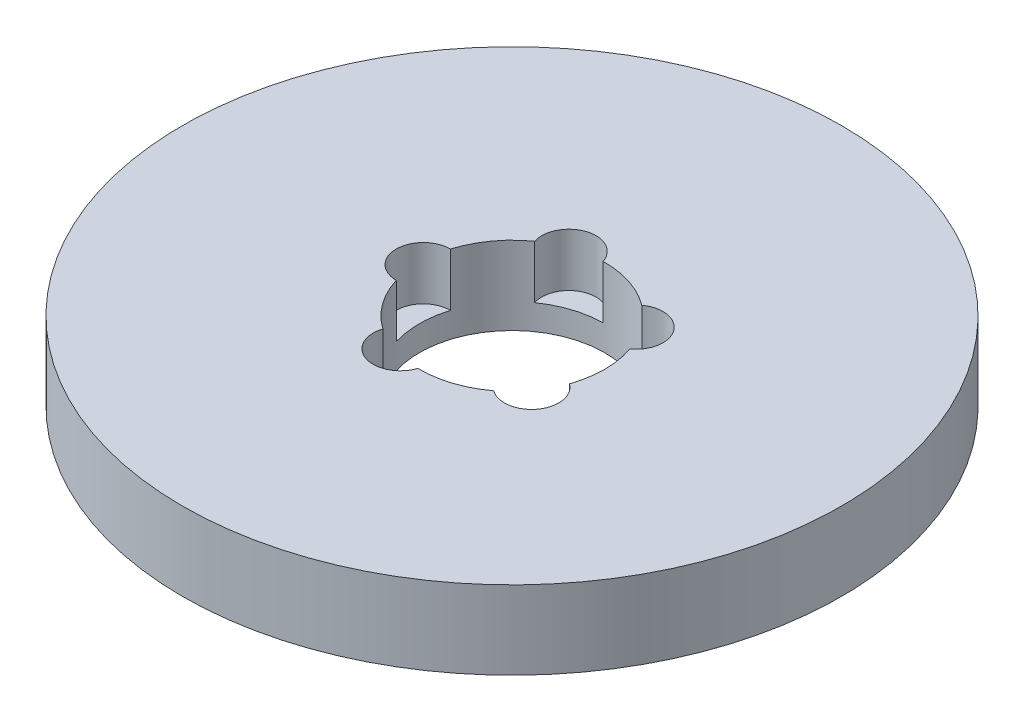
ISO-10303-21;
HEADER;
FILE_DESCRIPTION(('STEP AP214'),'2;1');
FILE_NAME('part.step','',(''),(''),'','','');
FILE_SCHEMA(('AUTOMOTIVE_DESIGN { 1 0 10303 214 1 1 1 1 }'));
ENDSEC;
DATA;
#1=APPLICATION_CONTEXT('core data for automotive mechanical design processes');
#2=APPLICATION_PROTOCOL_DEFINITION('international standard','automotive_design',2000,#1);
#3=PRODUCT_CONTEXT('',#1,'mechanical');
#4=PRODUCT('Part','Part','',(#3));
#5=PRODUCT_RELATED_PRODUCT_CATEGORY('part','',(#4));
#6=PRODUCT_DEFINITION_FORMATION('','',#4);
#7=PRODUCT_DEFINITION_CONTEXT('part definition',#1,'design');
#8=PRODUCT_DEFINITION('design','',#6,#7);
#9=PRODUCT_DEFINITION_SHAPE('','',#8);
#10=(LENGTH_UNIT() NAMED_UNIT(*) SI_UNIT(.MILLI.,.METRE.));
#11=(NAMED_UNIT(*) PLANE_ANGLE_UNIT() SI_UNIT($,.RADIAN.));
#12=(NAMED_UNIT(*) SI_UNIT($,.STERADIAN.) SOLID_ANGLE_UNIT());
#13=UNCERTAINTY_MEASURE_WITH_UNIT(LENGTH_MEASURE(1.E-05),#10,'distance_accuracy_value','');
#14=(GEOMETRIC_REPRESENTATION_CONTEXT(3) GLOBAL_UNCERTAINTY_ASSIGNED_CONTEXT((#13)) GLOBAL_UNIT_ASSIGNED_CONTEXT((#10,
#11,#12)) REPRESENTATION_CONTEXT('',''));
#15=CARTESIAN_POINT('',(0.,0.,0.));
#16=DIRECTION('',(0.,0.,1.));
#17=DIRECTION('',(1.,0.,0.));
#18=AXIS2_PLACEMENT_3D('',#15,#16,#17);
#19=CARTESIAN_POINT('',(0.,19.,0.));
#20=DIRECTION('',(0.,-1.,0.));
#21=DIRECTION('',(0.,0.,-1.));
#22=AXIS2_PLACEMENT_3D('',#19,#20,#21);
#23=CYLINDRICAL_SURFACE('',#22,80.);
#24=CARTESIAN_POINT('',(0.,19.,0.));
#25=DIRECTION('',(0.,1.,0.));
#26=DIRECTION('',(0.,0.,1.));
#27=AXIS2_PLACEMENT_3D('',#24,#25,#26);
#28=CIRCLE('',#27,80.);
#29=CARTESIAN_POINT('',(0.,19.,80.));
#30=VERTEX_POINT('',#29);
#31=EDGE_CURVE('E157',#30,#30,#28,.T.);
#32=ORIENTED_EDGE('',*,*,#31,.F.);
#33=EDGE_LOOP('',(#32));
#34=FACE_BOUND('',#33,.T.);
#35=CARTESIAN_POINT('',(0.,0.,0.));
#36=DIRECTION('',(0.,1.,0.));
#37=DIRECTION('',(0.,0.,1.));
#38=AXIS2_PLACEMENT_3D('',#35,#36,#37);
#39=CIRCLE('',#38,80.);
#40=CARTESIAN_POINT('',(0.,0.,80.));
#41=VERTEX_POINT('',#40);
#42=EDGE_CURVE('E150',#41,#41,#39,.T.);
#43=ORIENTED_EDGE('',*,*,#42,.T.);
#44=EDGE_LOOP('',(#43));
#45=FACE_BOUND('',#44,.T.);
#46=ADVANCED_FACE('F39',(#34,#45),#23,.T.);
#47=CARTESIAN_POINT('',(0.,19.,0.));
#48=DIRECTION('',(0.,1.,0.));
#49=DIRECTION('',(0.,0.,1.));
#50=AXIS2_PLACEMENT_3D('',#47,#48,#49);
#51=PLANE('',#50);
#52=CARTESIAN_POINT('',(-6.65133725210764,19.,-20.4707111610114));
#53=DIRECTION('',(0.,1.,0.));
#54=DIRECTION('',(-0.95105651629515,0.,0.309016994374958));
#55=AXIS2_PLACEMENT_3D('',#52,#53,#54);
#56=CIRCLE('',#55,6.58097979710222);
#57=CARTESIAN_POINT('',(-0.38994875628982,19.,-22.4966206343857));
#58=VERTEX_POINT('',#57);
#59=CARTESIAN_POINT('',(-12.907706664537,19.,-18.4293545373208));
#60=VERTEX_POINT('',#59);
#61=EDGE_CURVE('E194',#58,#60,#56,.T.);
#62=ORIENTED_EDGE('',*,*,#61,.F.);
#63=CARTESIAN_POINT('',(0.,19.,0.));
#64=DIRECTION('',(0.,1.,0.));
#65=DIRECTION('',(0.,0.,1.));
#66=AXIS2_PLACEMENT_3D('',#63,#64,#65);
#67=CIRCLE('',#66,22.5);
#68=CARTESIAN_POINT('',(13.5386570060839,19.,-17.9709422811275));
#69=VERTEX_POINT('',#68);
#70=EDGE_CURVE('E147',#69,#58,#67,.T.);
#71=ORIENTED_EDGE('',*,*,#70,.F.);
#72=CARTESIAN_POINT('',(17.4134269966554,19.,-12.6515952713871));
#73=DIRECTION('',(0.,1.,0.));
#74=DIRECTION('',(-0.58778525229248,0.,-0.809016994374942));
#75=AXIS2_PLACEMENT_3D('',#72,#73,#74);
#76=CIRCLE('',#75,6.58097979710222);
#77=CARTESIAN_POINT('',(21.2750568563236,19.,-7.32270139772186));
#78=VERTEX_POINT('',#77);
#79=EDGE_CURVE('E254',#78,#69,#76,.T.);
#80=ORIENTED_EDGE('',*,*,#79,.F.);
#81=CARTESIAN_POINT('',(21.2750568563237,19.,7.32270139772155));
#82=VERTEX_POINT('',#81);
#83=EDGE_CURVE('E144',#82,#78,#67,.T.);
#84=ORIENTED_EDGE('',*,*,#83,.F.);
#85=CARTESIAN_POINT('',(17.4134269966556,19.,12.6515952713868));
#86=DIRECTION('',(0.,1.,0.));
#87=DIRECTION('',(0.587785252292469,0.,-0.809016994374951));
#88=AXIS2_PLACEMENT_3D('',#85,#86,#87);
#89=CIRCLE('',#88,6.58097979710222);
#90=CARTESIAN_POINT('',(13.5386570060842,19.,17.9709422811273));
#91=VERTEX_POINT('',#90);
#92=EDGE_CURVE('E141',#91,#82,#89,.T.);
#93=ORIENTED_EDGE('',*,*,#92,.F.);
#94=CARTESIAN_POINT('',(-0.389948756289501,19.,22.4966206343857));
#95=VERTEX_POINT('',#94);
#96=EDGE_CURVE('E134',#95,#91,#67,.T.);
#97=ORIENTED_EDGE('',*,*,#96,.F.);
#98=CARTESIAN_POINT('',(-6.65133725210735,19.,20.4707111610115));
#99=DIRECTION('',(0.,1.,0.));
#100=DIRECTION('',(0.951056516295155,0.,0.309016994374945));
#101=AXIS2_PLACEMENT_3D('',#98,#99,#100);
#102=CIRCLE('',#101,6.58097979710222);
#103=CARTESIAN_POINT('',(-12.9077066645368,19.,18.429354537321));
#104=VERTEX_POINT('',#103);
#105=EDGE_CURVE('E111',#104,#95,#102,.T.);
#106=ORIENTED_EDGE('',*,*,#105,.F.);
#107=CARTESIAN_POINT('',(-21.5160584415814,19.,6.58097478634091));
#108=VERTEX_POINT('',#107);
#109=EDGE_CURVE('E145',#108,#104,#67,.T.);
#110=ORIENTED_EDGE('',*,*,#109,.F.);
#111=CARTESIAN_POINT('',(-21.5241794890962,19.,0.));
#112=DIRECTION('',(0.,1.,0.));
#113=DIRECTION('',(0.,0.,1.));
#114=AXIS2_PLACEMENT_3D('',#111,#112,#113);
#115=CIRCLE('',#114,6.58097979710222);
#116=CARTESIAN_POINT('',(-21.5160584415814,19.,-6.58097478634091));
#117=VERTEX_POINT('',#116);
#118=EDGE_CURVE('E153',#117,#108,#115,.T.);
#119=ORIENTED_EDGE('',*,*,#118,.F.);
#120=EDGE_CURVE('E146',#60,#117,#67,.T.);
#121=ORIENTED_EDGE('',*,*,#120,.F.);
#122=EDGE_LOOP('',(#62,#71,#80,#84,#93,#97,#106,#110,#119,#121));
#123=FACE_BOUND('',#122,.T.);
#124=ORIENTED_EDGE('',*,*,#31,.T.);
#125=EDGE_LOOP('',(#124));
#126=FACE_BOUND('',#125,.T.);
#127=ADVANCED_FACE('F139',(#123,#126),#51,.T.);
#128=CARTESIAN_POINT('',(0.,0.,0.));
#129=DIRECTION('',(0.,1.,0.));
#130=DIRECTION('',(0.,0.,1.));
#131=AXIS2_PLACEMENT_3D('',#128,#129,#130);
#132=PLANE('',#131);
#133=CARTESIAN_POINT('',(0.,0.,0.));
#134=DIRECTION('',(0.,1.,0.));
#135=DIRECTION('',(0.,0.,1.));
#136=AXIS2_PLACEMENT_3D('',#133,#134,#135);
#137=CIRCLE('',#136,22.5);
#138=CARTESIAN_POINT('',(0.,0.,22.5));
#139=VERTEX_POINT('',#138);
#140=EDGE_CURVE('E154',#139,#139,#137,.T.);
#141=ORIENTED_EDGE('',*,*,#140,.T.);
#142=EDGE_LOOP('',(#141));
#143=FACE_BOUND('',#142,.T.);
#144=ORIENTED_EDGE('',*,*,#42,.F.);
#145=EDGE_LOOP('',(#144));
#146=FACE_BOUND('',#145,.T.);
#147=ADVANCED_FACE('F213',(#143,#146),#132,.F.);
#148=CARTESIAN_POINT('',(0.,19.,0.));
#149=DIRECTION('',(0.,-1.,0.));
#150=DIRECTION('',(0.,0.,-1.));
#151=AXIS2_PLACEMENT_3D('',#148,#149,#150);
#152=CYLINDRICAL_SURFACE('',#151,22.5);
#153=DIRECTION('',(0.,1.,0.));
#154=VECTOR('',#153,1.);
#155=CARTESIAN_POINT('',(-0.389948756289821,12.5503713781089,-22.4966206343857));
#156=LINE('',#155,#154);
#157=CARTESIAN_POINT('',(-0.38994875628982,6.10074275621787,-22.4966206343857));
#158=VERTEX_POINT('',#157);
#159=EDGE_CURVE('E11',#158,#58,#156,.T.);
#160=ORIENTED_EDGE('',*,*,#159,.F.);
#161=CARTESIAN_POINT('',(0.,6.10074275621787,0.));
#162=DIRECTION('',(0.,1.,0.));
#163=DIRECTION('',(0.,0.,1.));
#164=AXIS2_PLACEMENT_3D('',#161,#162,#163);
#165=CIRCLE('',#164,22.5);
#166=CARTESIAN_POINT('',(-12.907706664537,6.10074275621787,-18.4293545373208));
#167=VERTEX_POINT('',#166);
#168=EDGE_CURVE('E189',#158,#167,#165,.T.);
#169=ORIENTED_EDGE('',*,*,#168,.T.);
#170=DIRECTION('',(0.,1.,0.));
#171=VECTOR('',#170,1.);
#172=CARTESIAN_POINT('',(-12.907706664537,12.5503713781089,-18.4293545373208));
#173=LINE('',#172,#171);
#174=EDGE_CURVE('E46',#60,#167,#173,.F.);
#175=ORIENTED_EDGE('',*,*,#174,.F.);
#176=ORIENTED_EDGE('',*,*,#120,.T.);
#177=DIRECTION('',(0.,1.,0.));
#178=VECTOR('',#177,1.);
#179=CARTESIAN_POINT('',(-21.5160584415814,12.5503713781089,-6.58097478634091));
#180=LINE('',#179,#178);
#181=CARTESIAN_POINT('',(-21.5160584415814,6.10074275621787,-6.58097478634091));
#182=VERTEX_POINT('',#181);
#183=EDGE_CURVE('E168',#182,#117,#180,.T.);
#184=ORIENTED_EDGE('',*,*,#183,.F.);
#185=CARTESIAN_POINT('',(0.,6.10074275621787,0.));
#186=DIRECTION('',(0.,1.,0.));
#187=DIRECTION('',(0.,0.,1.));
#188=AXIS2_PLACEMENT_3D('',#185,#186,#187);
#189=CIRCLE('',#188,22.5);
#190=CARTESIAN_POINT('',(-21.5160584415814,6.10074275621787,6.58097478634091));
#191=VERTEX_POINT('',#190);
#192=EDGE_CURVE('E165',#182,#191,#189,.T.);
#193=ORIENTED_EDGE('',*,*,#192,.T.);
#194=DIRECTION('',(0.,1.,0.));
#195=VECTOR('',#194,1.);
#196=CARTESIAN_POINT('',(-21.5160584415814,12.5503713781089,6.58097478634091));
#197=LINE('',#196,#195);
#198=EDGE_CURVE('E170',#108,#191,#197,.F.);
#199=ORIENTED_EDGE('',*,*,#198,.F.);
#200=ORIENTED_EDGE('',*,*,#109,.T.);
#201=DIRECTION('',(0.,1.,0.));
#202=VECTOR('',#201,1.);
#203=CARTESIAN_POINT('',(-12.9077066645368,12.5503713781089,18.429354537321));
#204=LINE('',#203,#202);
#205=CARTESIAN_POINT('',(-12.9077066645368,6.10074275621787,18.429354537321));
#206=VERTEX_POINT('',#205);
#207=EDGE_CURVE('E121',#206,#104,#204,.T.);
#208=ORIENTED_EDGE('',*,*,#207,.F.);
#209=CARTESIAN_POINT('',(0.,6.10074275621787,0.));
#210=DIRECTION('',(0.,1.,0.));
#211=DIRECTION('',(0.,0.,1.));
#212=AXIS2_PLACEMENT_3D('',#209,#210,#211);
#213=CIRCLE('',#212,22.5);
#214=CARTESIAN_POINT('',(-0.389948756289501,6.10074275621787,22.4966206343857));
#215=VERTEX_POINT('',#214);
#216=EDGE_CURVE('E136',#206,#215,#213,.T.);
#217=ORIENTED_EDGE('',*,*,#216,.T.);
#218=DIRECTION('',(0.,1.,0.));
#219=VECTOR('',#218,1.);
#220=CARTESIAN_POINT('',(-0.389948756289503,12.5503713781089,22.4966206343857));
#221=LINE('',#220,#219);
#222=EDGE_CURVE('E117',#95,#215,#221,.F.);
#223=ORIENTED_EDGE('',*,*,#222,.F.);
#224=ORIENTED_EDGE('',*,*,#96,.T.);
#225=DIRECTION('',(0.,1.,0.));
#226=VECTOR('',#225,1.);
#227=CARTESIAN_POINT('',(13.5386570060842,12.5503713781089,17.9709422811273));
#228=LINE('',#227,#226);
#229=CARTESIAN_POINT('',(13.5386570060842,6.10074275621787,17.9709422811273));
#230=VERTEX_POINT('',#229);
#231=EDGE_CURVE('E182',#230,#91,#228,.T.);
#232=ORIENTED_EDGE('',*,*,#231,.F.);
#233=CARTESIAN_POINT('',(0.,6.10074275621787,0.));
#234=DIRECTION('',(0.,1.,0.));
#235=DIRECTION('',(0.,0.,1.));
#236=AXIS2_PLACEMENT_3D('',#233,#234,#235);
#237=CIRCLE('',#236,22.5);
#238=CARTESIAN_POINT('',(21.2750568563237,6.10074275621787,7.32270139772155));
#239=VERTEX_POINT('',#238);
#240=EDGE_CURVE('E174',#230,#239,#237,.T.);
#241=ORIENTED_EDGE('',*,*,#240,.T.);
#242=DIRECTION('',(0.,1.,0.));
#243=VECTOR('',#242,1.);
#244=CARTESIAN_POINT('',(21.2750568563237,12.5503713781089,7.32270139772155));
#245=LINE('',#244,#243);
#246=EDGE_CURVE('E177',#82,#239,#245,.F.);
#247=ORIENTED_EDGE('',*,*,#246,.F.);
#248=ORIENTED_EDGE('',*,*,#83,.T.);
#249=DIRECTION('',(0.,1.,0.));
#250=VECTOR('',#249,1.);
#251=CARTESIAN_POINT('',(21.2750568563236,12.5503713781089,-7.32270139772186));
#252=LINE('',#251,#250);
#253=CARTESIAN_POINT('',(21.2750568563236,6.10074275621787,-7.32270139772186));
#254=VERTEX_POINT('',#253);
#255=EDGE_CURVE('E187',#254,#78,#252,.T.);
#256=ORIENTED_EDGE('',*,*,#255,.F.);
#257=CARTESIAN_POINT('',(0.,6.10074275621787,0.));
#258=DIRECTION('',(0.,1.,0.));
#259=DIRECTION('',(0.,0.,1.));
#260=AXIS2_PLACEMENT_3D('',#257,#258,#259);
#261=CIRCLE('',#260,22.5);
#262=CARTESIAN_POINT('',(13.5386570060839,6.10074275621787,-17.9709422811275));
#263=VERTEX_POINT('',#262);
#264=EDGE_CURVE('E181',#254,#263,#261,.T.);
#265=ORIENTED_EDGE('',*,*,#264,.T.);
#266=DIRECTION('',(0.,1.,0.));
#267=VECTOR('',#266,1.);
#268=CARTESIAN_POINT('',(13.5386570060839,12.5503713781089,-17.9709422811275));
#269=LINE('',#268,#267);
#270=EDGE_CURVE('E186',#69,#263,#269,.F.);
#271=ORIENTED_EDGE('',*,*,#270,.F.);
#272=ORIENTED_EDGE('',*,*,#70,.T.);
#273=EDGE_LOOP('',(#160,#169,#175,#176,#184,#193,#199,#200,#208,#217,#223,#224,#232,#241,#247,
#248,#256,#265,#271,#272));
#274=FACE_BOUND('',#273,.T.);
#275=ORIENTED_EDGE('',*,*,#140,.F.);
#276=EDGE_LOOP('',(#275));
#277=FACE_BOUND('',#276,.T.);
#278=ADVANCED_FACE('F135',(#274,#277),#152,.F.);
#279=CARTESIAN_POINT('',(-21.5241794890962,6.10074275621787,0.));
#280=DIRECTION('',(0.,1.,0.));
#281=DIRECTION('',(0.,0.,1.));
#282=AXIS2_PLACEMENT_3D('',#279,#280,#281);
#283=CYLINDRICAL_SURFACE('',#282,6.58097979710222);
#284=ORIENTED_EDGE('',*,*,#183,.T.);
#285=ORIENTED_EDGE('',*,*,#118,.T.);
#286=ORIENTED_EDGE('',*,*,#198,.T.);
#287=CARTESIAN_POINT('',(-21.5241794890962,6.10074275621787,0.));
#288=DIRECTION('',(0.,1.,0.));
#289=DIRECTION('',(0.,0.,1.));
#290=AXIS2_PLACEMENT_3D('',#287,#288,#289);
#291=CIRCLE('',#290,6.58097979710222);
#292=EDGE_CURVE('E158',#182,#191,#291,.T.);
#293=ORIENTED_EDGE('',*,*,#292,.F.);
#294=EDGE_LOOP('',(#284,#285,#286,#293));
#295=FACE_BOUND('',#294,.T.);
#296=ADVANCED_FACE('F221',(#295),#283,.F.);
#297=CARTESIAN_POINT('',(-21.5241794890962,6.10074275621787,0.));
#298=DIRECTION('',(0.,1.,0.));
#299=DIRECTION('',(0.,0.,1.));
#300=AXIS2_PLACEMENT_3D('',#297,#298,#299);
#301=PLANE('',#300);
#302=ORIENTED_EDGE('',*,*,#292,.T.);
#303=ORIENTED_EDGE('',*,*,#192,.F.);
#304=EDGE_LOOP('',(#302,#303));
#305=FACE_BOUND('',#304,.T.);
#306=ADVANCED_FACE('F227',(#305),#301,.T.);
#307=CARTESIAN_POINT('',(-6.65133725210735,6.10074275621787,20.4707111610115));
#308=DIRECTION('',(0.,1.,0.));
#309=DIRECTION('',(0.,0.,1.));
#310=AXIS2_PLACEMENT_3D('',#307,#308,#309);
#311=CYLINDRICAL_SURFACE('',#310,6.58097979710222);
#312=ORIENTED_EDGE('',*,*,#207,.T.);
#313=ORIENTED_EDGE('',*,*,#105,.T.);
#314=ORIENTED_EDGE('',*,*,#222,.T.);
#315=CARTESIAN_POINT('',(-6.65133725210735,6.10074275621787,20.4707111610115));
#316=DIRECTION('',(0.,1.,0.));
#317=DIRECTION('',(0.951056516295155,0.,0.309016994374945));
#318=AXIS2_PLACEMENT_3D('',#315,#316,#317);
#319=CIRCLE('',#318,6.58097979710222);
#320=EDGE_CURVE('E127',#206,#215,#319,.T.);
#321=ORIENTED_EDGE('',*,*,#320,.F.);
#322=EDGE_LOOP('',(#312,#313,#314,#321));
#323=FACE_BOUND('',#322,.T.);
#324=ADVANCED_FACE('F116',(#323),#311,.F.);
#325=CARTESIAN_POINT('',(-6.65133725210735,6.10074275621787,20.4707111610115));
#326=DIRECTION('',(0.,1.,0.));
#327=DIRECTION('',(0.951056516295155,0.,0.309016994374945));
#328=AXIS2_PLACEMENT_3D('',#325,#326,#327);
#329=PLANE('',#328);
#330=ORIENTED_EDGE('',*,*,#320,.T.);
#331=ORIENTED_EDGE('',*,*,#216,.F.);
#332=EDGE_LOOP('',(#330,#331));
#333=FACE_BOUND('',#332,.T.);
#334=ADVANCED_FACE('F234',(#333),#329,.T.);
#335=CARTESIAN_POINT('',(17.4134269966556,6.10074275621787,12.6515952713868));
#336=DIRECTION('',(0.,1.,0.));
#337=DIRECTION('',(0.,0.,1.));
#338=AXIS2_PLACEMENT_3D('',#335,#336,#337);
#339=CYLINDRICAL_SURFACE('',#338,6.58097979710222);
#340=ORIENTED_EDGE('',*,*,#231,.T.);
#341=ORIENTED_EDGE('',*,*,#92,.T.);
#342=ORIENTED_EDGE('',*,*,#246,.T.);
#343=CARTESIAN_POINT('',(17.4134269966556,6.10074275621787,12.6515952713868));
#344=DIRECTION('',(0.,1.,0.));
#345=DIRECTION('',(0.587785252292469,0.,-0.809016994374951));
#346=AXIS2_PLACEMENT_3D('',#343,#344,#345);
#347=CIRCLE('',#346,6.58097979710222);
#348=EDGE_CURVE('E130',#230,#239,#347,.T.);
#349=ORIENTED_EDGE('',*,*,#348,.F.);
#350=EDGE_LOOP('',(#340,#341,#342,#349));
#351=FACE_BOUND('',#350,.T.);
#352=ADVANCED_FACE('F240',(#351),#339,.F.);
#353=CARTESIAN_POINT('',(17.4134269966556,6.10074275621787,12.6515952713868));
#354=DIRECTION('',(0.,1.,0.));
#355=DIRECTION('',(0.587785252292469,0.,-0.809016994374951));
#356=AXIS2_PLACEMENT_3D('',#353,#354,#355);
#357=PLANE('',#356);
#358=ORIENTED_EDGE('',*,*,#348,.T.);
#359=ORIENTED_EDGE('',*,*,#240,.F.);
#360=EDGE_LOOP('',(#358,#359));
#361=FACE_BOUND('',#360,.T.);
#362=ADVANCED_FACE('F245',(#361),#357,.T.);
#363=CARTESIAN_POINT('',(17.4134269966554,6.10074275621787,-12.6515952713871));
#364=DIRECTION('',(0.,1.,0.));
#365=DIRECTION('',(0.,0.,1.));
#366=AXIS2_PLACEMENT_3D('',#363,#364,#365);
#367=CYLINDRICAL_SURFACE('',#366,6.58097979710222);
#368=ORIENTED_EDGE('',*,*,#255,.T.);
#369=ORIENTED_EDGE('',*,*,#79,.T.);
#370=ORIENTED_EDGE('',*,*,#270,.T.);
#371=CARTESIAN_POINT('',(17.4134269966554,6.10074275621787,-12.6515952713871));
#372=DIRECTION('',(0.,1.,0.));
#373=DIRECTION('',(-0.58778525229248,0.,-0.809016994374942));
#374=AXIS2_PLACEMENT_3D('',#371,#372,#373);
#375=CIRCLE('',#374,6.58097979710222);
#376=EDGE_CURVE('E56',#254,#263,#375,.T.);
#377=ORIENTED_EDGE('',*,*,#376,.F.);
#378=EDGE_LOOP('',(#368,#369,#370,#377));
#379=FACE_BOUND('',#378,.T.);
#380=ADVANCED_FACE('F266',(#379),#367,.F.);
#381=CARTESIAN_POINT('',(17.4134269966554,6.10074275621787,-12.6515952713871));
#382=DIRECTION('',(0.,1.,0.));
#383=DIRECTION('',(-0.58778525229248,0.,-0.809016994374942));
#384=AXIS2_PLACEMENT_3D('',#381,#382,#383);
#385=PLANE('',#384);
#386=ORIENTED_EDGE('',*,*,#376,.T.);
#387=ORIENTED_EDGE('',*,*,#264,.F.);
#388=EDGE_LOOP('',(#386,#387));
#389=FACE_BOUND('',#388,.T.);
#390=ADVANCED_FACE('F204',(#389),#385,.T.);
#391=CARTESIAN_POINT('',(-6.65133725210764,6.10074275621787,-20.4707111610114));
#392=DIRECTION('',(0.,1.,0.));
#393=DIRECTION('',(0.,0.,1.));
#394=AXIS2_PLACEMENT_3D('',#391,#392,#393);
#395=CYLINDRICAL_SURFACE('',#394,6.58097979710222);
#396=ORIENTED_EDGE('',*,*,#159,.T.);
#397=ORIENTED_EDGE('',*,*,#61,.T.);
#398=ORIENTED_EDGE('',*,*,#174,.T.);
#399=CARTESIAN_POINT('',(-6.65133725210764,6.10074275621787,-20.4707111610114));
#400=DIRECTION('',(0.,1.,0.));
#401=DIRECTION('',(-0.95105651629515,0.,0.309016994374958));
#402=AXIS2_PLACEMENT_3D('',#399,#400,#401);
#403=CIRCLE('',#402,6.58097979710222);
#404=EDGE_CURVE('E55',#158,#167,#403,.T.);
#405=ORIENTED_EDGE('',*,*,#404,.F.);
#406=EDGE_LOOP('',(#396,#397,#398,#405));
#407=FACE_BOUND('',#406,.T.);
#408=ADVANCED_FACE('F193',(#407),#395,.F.);
#409=CARTESIAN_POINT('',(-6.65133725210764,6.10074275621787,-20.4707111610114));
#410=DIRECTION('',(0.,1.,0.));
#411=DIRECTION('',(-0.95105651629515,0.,0.309016994374958));
#412=AXIS2_PLACEMENT_3D('',#409,#410,#411);
#413=PLANE('',#412);
#414=ORIENTED_EDGE('',*,*,#404,.T.);
#415=ORIENTED_EDGE('',*,*,#168,.F.);
#416=EDGE_LOOP('',(#414,#415));
#417=FACE_BOUND('',#416,.T.);
#418=ADVANCED_FACE('F196',(#417),#413,.T.);
#419=CLOSED_SHELL('',(#46,#127,#147,#278,#296,#306,#324,#334,#352,#362,#380,#390,#408,#418));
#420=MANIFOLD_SOLID_BREP('B2',#419);
#421=ADVANCED_BREP_SHAPE_REPRESENTATION('',(#18,#420),#14);
#422=SHAPE_DEFINITION_REPRESENTATION(#9,#421);
ENDSEC;
END-ISO-10303-21;
